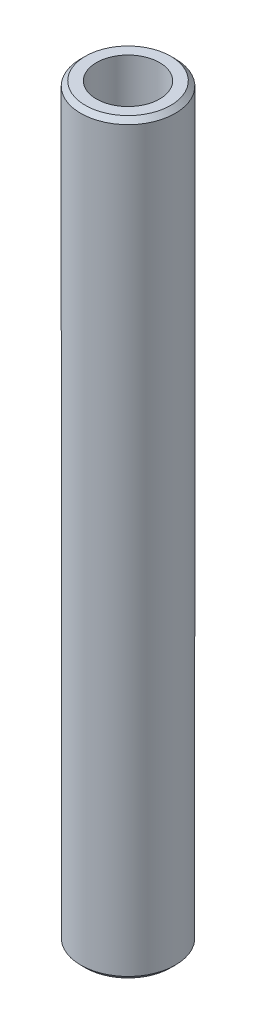
ISO-10303-21;
HEADER;
FILE_DESCRIPTION(('STEP AP214'),'2;1');
FILE_NAME('part.step','',(''),(''),'','','');
FILE_SCHEMA(('AUTOMOTIVE_DESIGN { 1 0 10303 214 1 1 1 1 }'));
ENDSEC;
DATA;
#1=APPLICATION_CONTEXT('core data for automotive mechanical design processes');
#2=APPLICATION_PROTOCOL_DEFINITION('international standard','automotive_design',2000,#1);
#3=PRODUCT_CONTEXT('',#1,'mechanical');
#4=PRODUCT('Part','Part','',(#3));
#5=PRODUCT_RELATED_PRODUCT_CATEGORY('part','',(#4));
#6=PRODUCT_DEFINITION_FORMATION('','',#4);
#7=PRODUCT_DEFINITION_CONTEXT('part definition',#1,'design');
#8=PRODUCT_DEFINITION('design','',#6,#7);
#9=PRODUCT_DEFINITION_SHAPE('','',#8);
#10=(LENGTH_UNIT() NAMED_UNIT(*) SI_UNIT(.MILLI.,.METRE.));
#11=(NAMED_UNIT(*) PLANE_ANGLE_UNIT() SI_UNIT($,.RADIAN.));
#12=(NAMED_UNIT(*) SI_UNIT($,.STERADIAN.) SOLID_ANGLE_UNIT());
#13=UNCERTAINTY_MEASURE_WITH_UNIT(LENGTH_MEASURE(1.E-05),#10,'distance_accuracy_value','');
#14=(GEOMETRIC_REPRESENTATION_CONTEXT(3) GLOBAL_UNCERTAINTY_ASSIGNED_CONTEXT((#13)) GLOBAL_UNIT_ASSIGNED_CONTEXT((#10,
#11,#12)) REPRESENTATION_CONTEXT('',''));
#15=CARTESIAN_POINT('',(0.,0.,0.));
#16=DIRECTION('',(0.,0.,1.));
#17=DIRECTION('',(1.,0.,0.));
#18=AXIS2_PLACEMENT_3D('',#15,#16,#17);
#19=CARTESIAN_POINT('',(0.,553.237199262776,0.));
#20=DIRECTION('',(0.,-1.,0.));
#21=DIRECTION('',(0.,0.,-1.));
#22=AXIS2_PLACEMENT_3D('',#19,#20,#21);
#23=CYLINDRICAL_SURFACE('',#22,35.);
#24=CARTESIAN_POINT('',(0.,549.832722694699,0.));
#25=DIRECTION('',(0.,1.,0.));
#26=DIRECTION('',(0.,0.,1.));
#27=AXIS2_PLACEMENT_3D('',#24,#25,#26);
#28=CIRCLE('',#27,35.);
#29=CARTESIAN_POINT('',(0.,549.832722694699,-35.0000000000001));
#30=VERTEX_POINT('',#29);
#31=EDGE_CURVE('E50',#30,#30,#28,.F.);
#32=ORIENTED_EDGE('',*,*,#31,.T.);
#33=EDGE_LOOP('',(#32));
#34=FACE_BOUND('',#33,.T.);
#35=CARTESIAN_POINT('',(0.,3.40447656807741,0.));
#36=DIRECTION('',(0.,1.,0.));
#37=DIRECTION('',(0.,0.,1.));
#38=AXIS2_PLACEMENT_3D('',#35,#36,#37);
#39=CIRCLE('',#38,35.);
#40=CARTESIAN_POINT('',(0.,3.40447656807741,35.));
#41=VERTEX_POINT('',#40);
#42=EDGE_CURVE('E51',#41,#41,#39,.T.);
#43=ORIENTED_EDGE('',*,*,#42,.T.);
#44=EDGE_LOOP('',(#43));
#45=FACE_BOUND('',#44,.T.);
#46=ADVANCED_FACE('F39',(#34,#45),#23,.T.);
#47=CARTESIAN_POINT('',(0.,553.237199262776,0.));
#48=DIRECTION('',(0.,1.,0.));
#49=DIRECTION('',(0.,0.,1.));
#50=AXIS2_PLACEMENT_3D('',#47,#48,#49);
#51=PLANE('',#50);
#52=CARTESIAN_POINT('',(0.,553.237199262776,0.));
#53=DIRECTION('',(0.,1.,0.));
#54=DIRECTION('',(0.,0.,1.));
#55=AXIS2_PLACEMENT_3D('',#52,#53,#54);
#56=CIRCLE('',#55,31.5955234319226);
#57=CARTESIAN_POINT('',(0.,553.237199262776,-31.5955234319227));
#58=VERTEX_POINT('',#57);
#59=EDGE_CURVE('E54',#58,#58,#56,.T.);
#60=ORIENTED_EDGE('',*,*,#59,.T.);
#61=EDGE_LOOP('',(#60));
#62=FACE_BOUND('',#61,.T.);
#63=CARTESIAN_POINT('',(0.,553.237199262776,0.));
#64=DIRECTION('',(0.,1.,0.));
#65=DIRECTION('',(0.,0.,1.));
#66=AXIS2_PLACEMENT_3D('',#63,#64,#65);
#67=CIRCLE('',#66,23.4024360830723);
#68=CARTESIAN_POINT('',(0.,553.237199262776,23.4024360830723));
#69=VERTEX_POINT('',#68);
#70=EDGE_CURVE('E58',#69,#69,#67,.T.);
#71=ORIENTED_EDGE('',*,*,#70,.F.);
#72=EDGE_LOOP('',(#71));
#73=FACE_BOUND('',#72,.T.);
#74=ADVANCED_FACE('F69',(#62,#73),#51,.T.);
#75=CARTESIAN_POINT('',(0.,0.,0.));
#76=DIRECTION('',(0.,1.,0.));
#77=DIRECTION('',(0.,0.,1.));
#78=AXIS2_PLACEMENT_3D('',#75,#76,#77);
#79=PLANE('',#78);
#80=CARTESIAN_POINT('',(0.,0.,0.));
#81=DIRECTION('',(0.,1.,0.));
#82=DIRECTION('',(0.,0.,1.));
#83=AXIS2_PLACEMENT_3D('',#80,#81,#82);
#84=CIRCLE('',#83,31.5955234319226);
#85=CARTESIAN_POINT('',(0.,0.,31.5955234319226));
#86=VERTEX_POINT('',#85);
#87=EDGE_CURVE('E10',#86,#86,#84,.F.);
#88=ORIENTED_EDGE('',*,*,#87,.T.);
#89=EDGE_LOOP('',(#88));
#90=FACE_BOUND('',#89,.T.);
#91=CARTESIAN_POINT('',(0.,0.,0.));
#92=DIRECTION('',(0.,1.,0.));
#93=DIRECTION('',(0.,0.,1.));
#94=AXIS2_PLACEMENT_3D('',#91,#92,#93);
#95=CIRCLE('',#94,23.4024360830723);
#96=CARTESIAN_POINT('',(0.,0.,23.4024360830723));
#97=VERTEX_POINT('',#96);
#98=EDGE_CURVE('E63',#97,#97,#95,.T.);
#99=ORIENTED_EDGE('',*,*,#98,.T.);
#100=EDGE_LOOP('',(#99));
#101=FACE_BOUND('',#100,.T.);
#102=ADVANCED_FACE('F75',(#90,#101),#79,.F.);
#103=CARTESIAN_POINT('',(0.,553.237199262776,0.));
#104=DIRECTION('',(0.,-1.,0.));
#105=DIRECTION('',(0.,0.,-1.));
#106=AXIS2_PLACEMENT_3D('',#103,#104,#105);
#107=CYLINDRICAL_SURFACE('',#106,23.4024360830723);
#108=ORIENTED_EDGE('',*,*,#70,.T.);
#109=EDGE_LOOP('',(#108));
#110=FACE_BOUND('',#109,.T.);
#111=ORIENTED_EDGE('',*,*,#98,.F.);
#112=EDGE_LOOP('',(#111));
#113=FACE_BOUND('',#112,.T.);
#114=ADVANCED_FACE('F70',(#110,#113),#107,.F.);
#115=CARTESIAN_POINT('',(0.,553.237199262776,0.));
#116=DIRECTION('',(0.,-1.,0.));
#117=DIRECTION('',(0.,0.,-1.));
#118=AXIS2_PLACEMENT_3D('',#115,#116,#117);
#119=CONICAL_SURFACE('',#118,31.5955234319226,0.785398163397461);
#120=CARTESIAN_POINT('',(0.,549.832722694699,-35.0000000000001));
#121=CARTESIAN_POINT('',(0.,549.868185992283,-34.9645367024159));
#122=CARTESIAN_POINT('',(0.,549.903649289867,-34.9290734048318));
#123=CARTESIAN_POINT('',(0.,549.974575885036,-34.8581468096635));
#124=CARTESIAN_POINT('',(0.,550.01003918262,-34.8226835120794));
#125=CARTESIAN_POINT('',(0.,550.080965777788,-34.7517569169111));
#126=CARTESIAN_POINT('',(0.,550.116429075372,-34.7162936193269));
#127=CARTESIAN_POINT('',(0.,550.18735567054,-34.6453670241587));
#128=CARTESIAN_POINT('',(0.,550.222818968125,-34.6099037265745));
#129=CARTESIAN_POINT('',(0.,550.293745563293,-34.5389771314063));
#130=CARTESIAN_POINT('',(0.,550.329208860877,-34.5035138338221));
#131=CARTESIAN_POINT('',(0.,550.400135456045,-34.4325872386538));
#132=CARTESIAN_POINT('',(0.,550.435598753629,-34.3971239410697));
#133=CARTESIAN_POINT('',(0.,550.506525348798,-34.3261973459014));
#134=CARTESIAN_POINT('',(0.,550.541988646382,-34.2907340483173));
#135=CARTESIAN_POINT('',(0.,550.61291524155,-34.219807453149));
#136=CARTESIAN_POINT('',(0.,550.648378539134,-34.1843441555649));
#137=CARTESIAN_POINT('',(0.,550.719305134302,-34.1134175603966));
#138=CARTESIAN_POINT('',(0.,550.754768431887,-34.0779542628124));
#139=CARTESIAN_POINT('',(0.,550.825695027055,-34.0070276676442));
#140=CARTESIAN_POINT('',(0.,550.861158324639,-33.97156437006));
#141=CARTESIAN_POINT('',(0.,550.932084919807,-33.9006377748918));
#142=CARTESIAN_POINT('',(0.,550.967548217391,-33.8651744773076));
#143=CARTESIAN_POINT('',(0.,551.03847481256,-33.7942478821393));
#144=CARTESIAN_POINT('',(0.,551.073938110144,-33.7587845845552));
#145=CARTESIAN_POINT('',(0.,551.144864705312,-33.6878579893869));
#146=CARTESIAN_POINT('',(0.,551.180328002896,-33.6523946918028));
#147=CARTESIAN_POINT('',(0.,551.251254598065,-33.5814680966345));
#148=CARTESIAN_POINT('',(0.,551.286717895649,-33.5460047990504));
#149=CARTESIAN_POINT('',(0.,551.357644490817,-33.4750782038821));
#150=CARTESIAN_POINT('',(0.,551.393107788401,-33.4396149062979));
#151=CARTESIAN_POINT('',(0.,551.464034383569,-33.3686883111296));
#152=CARTESIAN_POINT('',(0.,551.499497681153,-33.3332250135455));
#153=CARTESIAN_POINT('',(0.,551.570424276322,-33.2622984183772));
#154=CARTESIAN_POINT('',(0.,551.605887573906,-33.2268351207931));
#155=CARTESIAN_POINT('',(0.,551.676814169074,-33.1559085256248));
#156=CARTESIAN_POINT('',(0.,551.712277466658,-33.1204452280407));
#157=CARTESIAN_POINT('',(0.,551.783204061827,-33.0495186328724));
#158=CARTESIAN_POINT('',(0.,551.818667359411,-33.0140553352883));
#159=CARTESIAN_POINT('',(0.,551.889593954579,-32.94312874012));
#160=CARTESIAN_POINT('',(0.,551.925057252163,-32.9076654425358));
#161=CARTESIAN_POINT('',(0.,551.995983847332,-32.8367388473675));
#162=CARTESIAN_POINT('',(0.,552.031447144916,-32.8012755497834));
#163=CARTESIAN_POINT('',(0.,552.102373740084,-32.7303489546152));
#164=CARTESIAN_POINT('',(0.,552.137837037668,-32.694885657031));
#165=CARTESIAN_POINT('',(0.,552.208763632836,-32.6239590618627));
#166=CARTESIAN_POINT('',(0.,552.24422693042,-32.5884957642786));
#167=CARTESIAN_POINT('',(0.,552.315153525589,-32.5175691691103));
#168=CARTESIAN_POINT('',(0.,552.350616823173,-32.4821058715262));
#169=CARTESIAN_POINT('',(0.,552.421543418341,-32.4111792763579));
#170=CARTESIAN_POINT('',(0.,552.457006715925,-32.3757159787738));
#171=CARTESIAN_POINT('',(0.,552.527933311094,-32.3047893836055));
#172=CARTESIAN_POINT('',(0.,552.563396608678,-32.2693260860213));
#173=CARTESIAN_POINT('',(0.,552.634323203846,-32.198399490853));
#174=CARTESIAN_POINT('',(0.,552.66978650143,-32.1629361932689));
#175=CARTESIAN_POINT('',(0.,552.740713096598,-32.0920095981006));
#176=CARTESIAN_POINT('',(0.,552.776176394183,-32.0565463005165));
#177=CARTESIAN_POINT('',(0.,552.847102989351,-31.9856197053482));
#178=CARTESIAN_POINT('',(0.,552.882566286935,-31.9501564077641));
#179=CARTESIAN_POINT('',(0.,552.953492882103,-31.8792298125958));
#180=CARTESIAN_POINT('',(0.,552.988956179687,-31.8437665150117));
#181=CARTESIAN_POINT('',(0.,553.059882774856,-31.7728399198434));
#182=CARTESIAN_POINT('',(0.,553.09534607244,-31.7373766222592));
#183=CARTESIAN_POINT('',(0.,553.166272667608,-31.666450027091));
#184=CARTESIAN_POINT('',(0.,553.201735965192,-31.6309867295068));
#185=CARTESIAN_POINT('',(0.,553.237199262776,-31.5955234319227));
#186=B_SPLINE_CURVE_WITH_KNOTS('',3,(#120,#121,#122,#123,#124,#125,#126,#127,#128,#129,#130,
#131,#132,#133,#134,#135,#136,#137,#138,#139,#140,#141,#142,#143,#144,#145,#146,#147,#148,#149,
#150,#151,#152,#153,#154,#155,#156,#157,#158,#159,#160,#161,#162,#163,#164,#165,#166,#167,#168,
#169,#170,#171,#172,#173,#174,#175,#176,#177,#178,#179,#180,#181,#182,#183,#184,#185),
.UNSPECIFIED.,.F.,.F.,(4,2,2,2,2,2,2,2,2,2,2,2,2,2,2,2,2,2,2,2,2,2,2,2,2,2,2,2,2,2,2,2,4),(0.,
0.150458029229924,0.300916058459849,0.451374087689695,0.601832116919619,0.75229014614946,
0.902748175379384,1.05320620460923,1.20366423383915,1.354122263069,1.50458029229892,
1.65503832152877,1.80549635075869,1.95595437998854,2.10641240921847,2.25687043844831,
2.40732846767823,2.55778649690815,2.708244526138,2.85870255536793,3.00916058459777,
3.1596186138277,3.31007664305754,3.46053467228747,3.61099270151731,3.76145073074724,
3.91190875997708,4.062366789207,4.21282481843685,4.36328284766677,4.51374087689662,
4.66419890612654,4.81465693535647),.UNSPECIFIED.);
#187=EDGE_CURVE('BSEAM81',#30,#58,#186,.T.);
#188=ORIENTED_EDGE('',*,*,#31,.F.);
#189=ORIENTED_EDGE('',*,*,#59,.F.);
#190=ORIENTED_EDGE('',*,*,#187,.T.);
#191=ORIENTED_EDGE('',*,*,#187,.F.);
#192=EDGE_LOOP('',(#188,#190,#189,#191));
#193=FACE_BOUND('',#192,.T.);
#194=ADVANCED_FACE('F81',(#193),#119,.T.);
#195=CARTESIAN_POINT('',(0.,3.40447656807741,0.));
#196=DIRECTION('',(0.,1.,0.));
#197=DIRECTION('',(0.,0.,1.));
#198=AXIS2_PLACEMENT_3D('',#195,#196,#197);
#199=CONICAL_SURFACE('',#198,35.,0.785398163397453);
#200=ORIENTED_EDGE('',*,*,#87,.F.);
#201=EDGE_LOOP('',(#200));
#202=FACE_BOUND('',#201,.T.);
#203=ORIENTED_EDGE('',*,*,#42,.F.);
#204=EDGE_LOOP('',(#203));
#205=FACE_BOUND('',#204,.T.);
#206=ADVANCED_FACE('F45',(#202,#205),#199,.T.);
#207=CLOSED_SHELL('',(#46,#74,#102,#114,#194,#206));
#208=MANIFOLD_SOLID_BREP('B2',#207);
#209=ADVANCED_BREP_SHAPE_REPRESENTATION('',(#18,#208),#14);
#210=SHAPE_DEFINITION_REPRESENTATION(#9,#209);
ENDSEC;
END-ISO-10303-21;
